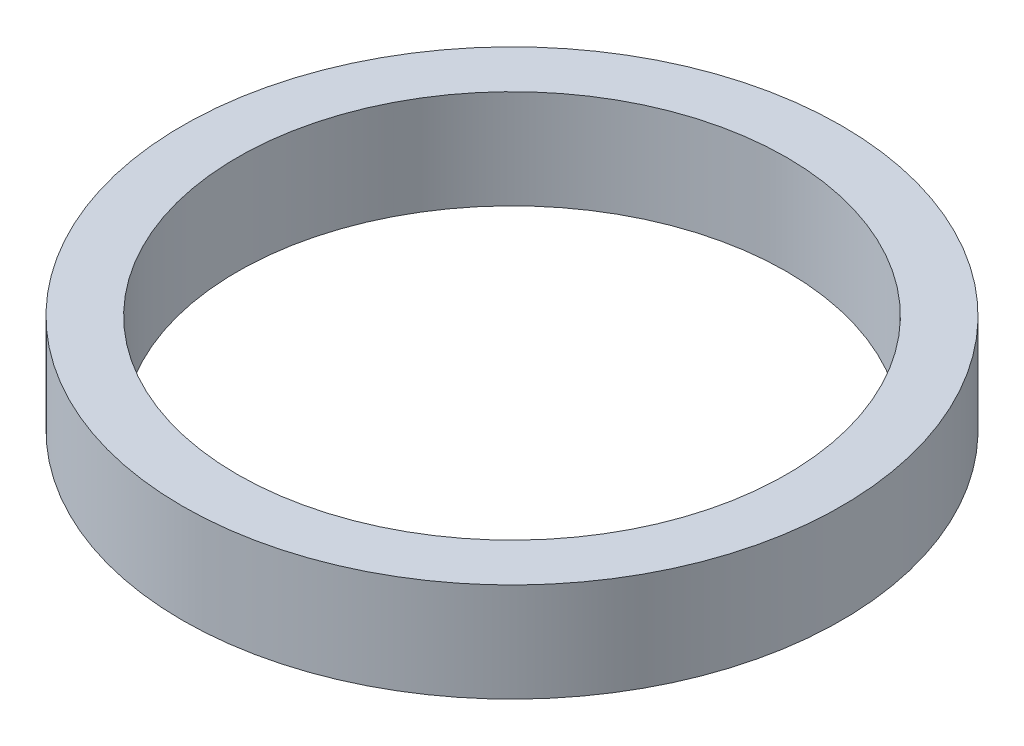
ISO-10303-21;
HEADER;
FILE_DESCRIPTION(('STEP AP214'),'2;1');
FILE_NAME('part.step','',(''),(''),'','','');
FILE_SCHEMA(('AUTOMOTIVE_DESIGN { 1 0 10303 214 1 1 1 1 }'));
ENDSEC;
DATA;
#1=APPLICATION_CONTEXT('core data for automotive mechanical design processes');
#2=APPLICATION_PROTOCOL_DEFINITION('international standard','automotive_design',2000,#1);
#3=PRODUCT_CONTEXT('',#1,'mechanical');
#4=PRODUCT('Part','Part','',(#3));
#5=PRODUCT_RELATED_PRODUCT_CATEGORY('part','',(#4));
#6=PRODUCT_DEFINITION_FORMATION('','',#4);
#7=PRODUCT_DEFINITION_CONTEXT('part definition',#1,'design');
#8=PRODUCT_DEFINITION('design','',#6,#7);
#9=PRODUCT_DEFINITION_SHAPE('','',#8);
#10=(LENGTH_UNIT() NAMED_UNIT(*) SI_UNIT(.MILLI.,.METRE.));
#11=(NAMED_UNIT(*) PLANE_ANGLE_UNIT() SI_UNIT($,.RADIAN.));
#12=(NAMED_UNIT(*) SI_UNIT($,.STERADIAN.) SOLID_ANGLE_UNIT());
#13=UNCERTAINTY_MEASURE_WITH_UNIT(LENGTH_MEASURE(1.E-05),#10,'distance_accuracy_value','');
#14=(GEOMETRIC_REPRESENTATION_CONTEXT(3) GLOBAL_UNCERTAINTY_ASSIGNED_CONTEXT((#13)) GLOBAL_UNIT_ASSIGNED_CONTEXT((#10,
#11,#12)) REPRESENTATION_CONTEXT('',''));
#15=CARTESIAN_POINT('',(0.,0.,0.));
#16=DIRECTION('',(0.,0.,1.));
#17=DIRECTION('',(1.,0.,0.));
#18=AXIS2_PLACEMENT_3D('',#15,#16,#17);
#19=CARTESIAN_POINT('',(0.,18.,0.));
#20=DIRECTION('',(0.,-1.,0.));
#21=DIRECTION('',(0.,0.,-1.));
#22=AXIS2_PLACEMENT_3D('',#19,#20,#21);
#23=CYLINDRICAL_SURFACE('',#22,60.);
#24=CARTESIAN_POINT('',(0.,18.,0.));
#25=DIRECTION('',(0.,1.,0.));
#26=DIRECTION('',(0.,0.,1.));
#27=AXIS2_PLACEMENT_3D('',#24,#25,#26);
#28=CIRCLE('',#27,60.);
#29=CARTESIAN_POINT('',(0.,18.,60.));
#30=VERTEX_POINT('',#29);
#31=EDGE_CURVE('E10',#30,#30,#28,.T.);
#32=ORIENTED_EDGE('',*,*,#31,.F.);
#33=EDGE_LOOP('',(#32));
#34=FACE_BOUND('',#33,.T.);
#35=CARTESIAN_POINT('',(0.,0.,0.));
#36=DIRECTION('',(0.,1.,0.));
#37=DIRECTION('',(0.,0.,1.));
#38=AXIS2_PLACEMENT_3D('',#35,#36,#37);
#39=CIRCLE('',#38,60.);
#40=CARTESIAN_POINT('',(0.,0.,60.));
#41=VERTEX_POINT('',#40);
#42=EDGE_CURVE('E37',#41,#41,#39,.T.);
#43=ORIENTED_EDGE('',*,*,#42,.T.);
#44=EDGE_LOOP('',(#43));
#45=FACE_BOUND('',#44,.T.);
#46=ADVANCED_FACE('F40',(#34,#45),#23,.T.);
#47=CARTESIAN_POINT('',(0.,18.,0.));
#48=DIRECTION('',(0.,1.,0.));
#49=DIRECTION('',(0.,0.,1.));
#50=AXIS2_PLACEMENT_3D('',#47,#48,#49);
#51=PLANE('',#50);
#52=CARTESIAN_POINT('',(0.,18.,0.));
#53=DIRECTION('',(0.,1.,0.));
#54=DIRECTION('',(0.,0.,1.));
#55=AXIS2_PLACEMENT_3D('',#52,#53,#54);
#56=CIRCLE('',#55,50.);
#57=CARTESIAN_POINT('',(0.,18.,50.));
#58=VERTEX_POINT('',#57);
#59=EDGE_CURVE('E50',#58,#58,#56,.T.);
#60=ORIENTED_EDGE('',*,*,#59,.F.);
#61=EDGE_LOOP('',(#60));
#62=FACE_BOUND('',#61,.T.);
#63=ORIENTED_EDGE('',*,*,#31,.T.);
#64=EDGE_LOOP('',(#63));
#65=FACE_BOUND('',#64,.T.);
#66=ADVANCED_FACE('F59',(#62,#65),#51,.T.);
#67=CARTESIAN_POINT('',(0.,0.,0.));
#68=DIRECTION('',(0.,1.,0.));
#69=DIRECTION('',(0.,0.,1.));
#70=AXIS2_PLACEMENT_3D('',#67,#68,#69);
#71=PLANE('',#70);
#72=CARTESIAN_POINT('',(0.,0.,0.));
#73=DIRECTION('',(0.,1.,0.));
#74=DIRECTION('',(0.,0.,1.));
#75=AXIS2_PLACEMENT_3D('',#72,#73,#74);
#76=CIRCLE('',#75,50.);
#77=CARTESIAN_POINT('',(0.,0.,50.));
#78=VERTEX_POINT('',#77);
#79=EDGE_CURVE('E47',#78,#78,#76,.T.);
#80=ORIENTED_EDGE('',*,*,#79,.T.);
#81=EDGE_LOOP('',(#80));
#82=FACE_BOUND('',#81,.T.);
#83=ORIENTED_EDGE('',*,*,#42,.F.);
#84=EDGE_LOOP('',(#83));
#85=FACE_BOUND('',#84,.T.);
#86=ADVANCED_FACE('F58',(#82,#85),#71,.F.);
#87=CARTESIAN_POINT('',(0.,18.,0.));
#88=DIRECTION('',(0.,-1.,0.));
#89=DIRECTION('',(0.,0.,-1.));
#90=AXIS2_PLACEMENT_3D('',#87,#88,#89);
#91=CYLINDRICAL_SURFACE('',#90,50.);
#92=ORIENTED_EDGE('',*,*,#59,.T.);
#93=EDGE_LOOP('',(#92));
#94=FACE_BOUND('',#93,.T.);
#95=ORIENTED_EDGE('',*,*,#79,.F.);
#96=EDGE_LOOP('',(#95));
#97=FACE_BOUND('',#96,.T.);
#98=ADVANCED_FACE('F54',(#94,#97),#91,.F.);
#99=CLOSED_SHELL('',(#46,#66,#86,#98));
#100=MANIFOLD_SOLID_BREP('B2',#99);
#101=ADVANCED_BREP_SHAPE_REPRESENTATION('',(#18,#100),#14);
#102=SHAPE_DEFINITION_REPRESENTATION(#9,#101);
ENDSEC;
END-ISO-10303-21;
